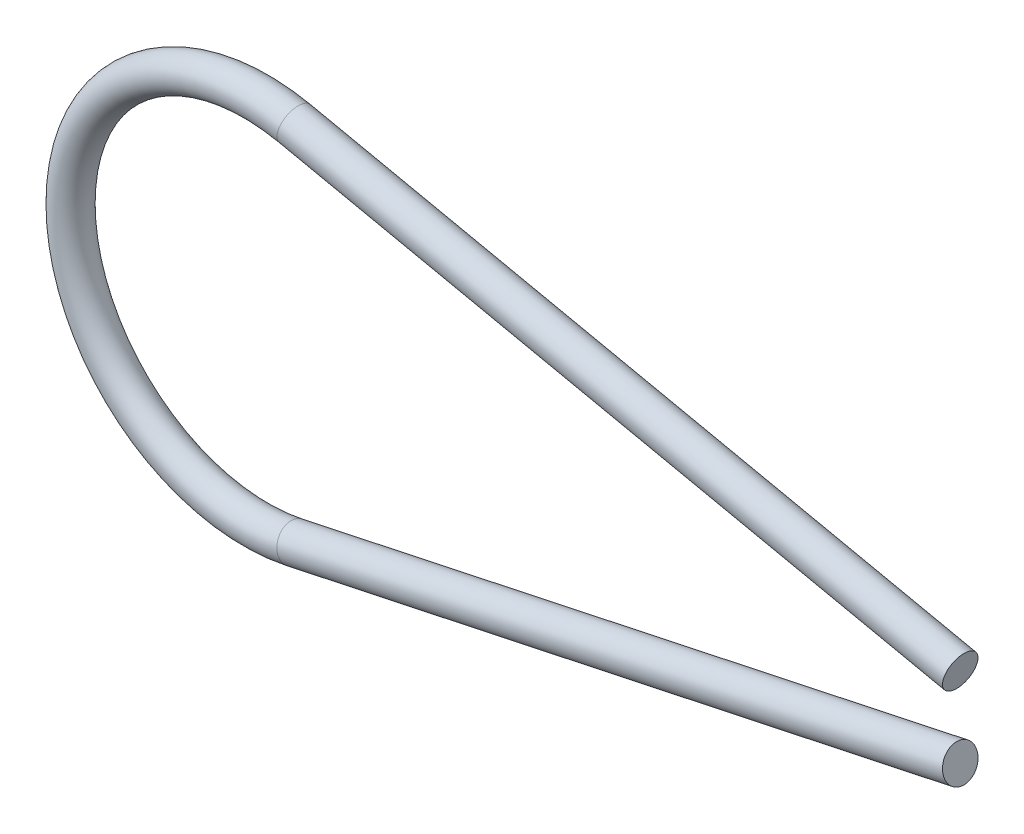
ISO-10303-21;
HEADER;
FILE_DESCRIPTION(('STEP AP214'),'2;1');
FILE_NAME('part.step','',(''),(''),'','','');
FILE_SCHEMA(('AUTOMOTIVE_DESIGN { 1 0 10303 214 1 1 1 1 }'));
ENDSEC;
DATA;
#1=APPLICATION_CONTEXT('core data for automotive mechanical design processes');
#2=APPLICATION_PROTOCOL_DEFINITION('international standard','automotive_design',2000,#1);
#3=PRODUCT_CONTEXT('',#1,'mechanical');
#4=PRODUCT('Part','Part','',(#3));
#5=PRODUCT_RELATED_PRODUCT_CATEGORY('part','',(#4));
#6=PRODUCT_DEFINITION_FORMATION('','',#4);
#7=PRODUCT_DEFINITION_CONTEXT('part definition',#1,'design');
#8=PRODUCT_DEFINITION('design','',#6,#7);
#9=PRODUCT_DEFINITION_SHAPE('','',#8);
#10=(LENGTH_UNIT() NAMED_UNIT(*) SI_UNIT(.MILLI.,.METRE.));
#11=(NAMED_UNIT(*) PLANE_ANGLE_UNIT() SI_UNIT($,.RADIAN.));
#12=(NAMED_UNIT(*) SI_UNIT($,.STERADIAN.) SOLID_ANGLE_UNIT());
#13=UNCERTAINTY_MEASURE_WITH_UNIT(LENGTH_MEASURE(1.E-05),#10,'distance_accuracy_value','');
#14=(GEOMETRIC_REPRESENTATION_CONTEXT(3) GLOBAL_UNCERTAINTY_ASSIGNED_CONTEXT((#13)) GLOBAL_UNIT_ASSIGNED_CONTEXT((#10,
#11,#12)) REPRESENTATION_CONTEXT('',''));
#15=CARTESIAN_POINT('',(0.,0.,0.));
#16=DIRECTION('',(0.,0.,1.));
#17=DIRECTION('',(1.,0.,0.));
#18=AXIS2_PLACEMENT_3D('',#15,#16,#17);
#19=CARTESIAN_POINT('',(0.332658705310615,-1.56503616118434,0.));
#20=DIRECTION('',(0.978147600733428,0.207911690819536,0.));
#21=DIRECTION('',(-0.207911690819536,0.978147600733428,0.));
#22=AXIS2_PLACEMENT_3D('',#19,#20,#21);
#23=CYLINDRICAL_SURFACE('',#22,0.15);
#24=CARTESIAN_POINT('',(0.332658705310615,-1.56503616118434,0.));
#25=DIRECTION('',(0.978147600734558,0.207911690814221,0.));
#26=DIRECTION('',(-0.207911690814221,0.978147600734558,0.));
#27=AXIS2_PLACEMENT_3D('',#24,#25,#26);
#28=CIRCLE('',#27,0.15);
#29=CARTESIAN_POINT('',(0.363845458933281,-1.71175830129441,0.));
#30=VERTEX_POINT('',#29);
#31=EDGE_CURVE('E39',#30,#30,#28,.T.);
#32=ORIENTED_EDGE('',*,*,#31,.T.);
#33=EDGE_LOOP('',(#32));
#34=FACE_BOUND('',#33,.T.);
#35=CARTESIAN_POINT('',(6.07438512161584,-0.344594536073662,0.));
#36=DIRECTION('',(0.978147600734558,0.207911690814221,0.));
#37=DIRECTION('',(-0.207911690814221,0.978147600734558,0.));
#38=AXIS2_PLACEMENT_3D('',#35,#36,#37);
#39=CIRCLE('',#38,0.15);
#40=CARTESIAN_POINT('',(6.04319836799371,-0.197872395963478,0.));
#41=VERTEX_POINT('',#40);
#42=EDGE_CURVE('E10',#41,#41,#39,.T.);
#43=ORIENTED_EDGE('',*,*,#42,.F.);
#44=EDGE_LOOP('',(#43));
#45=FACE_BOUND('',#44,.T.);
#46=ADVANCED_FACE('F33',(#34,#45),#23,.T.);
#47=CARTESIAN_POINT('',(0.,0.,0.));
#48=DIRECTION('',(0.,0.,1.));
#49=DIRECTION('',(1.,0.,0.));
#50=AXIS2_PLACEMENT_3D('',#47,#48,#49);
#51=TOROIDAL_SURFACE('',#50,1.60000000001048,0.15);
#52=CARTESIAN_POINT('',(0.332658705310596,1.56503616118434,0.));
#53=DIRECTION('',(-0.978147600733051,0.207911690821312,0.));
#54=DIRECTION('',(-0.207911690821312,-0.978147600733051,0.));
#55=AXIS2_PLACEMENT_3D('',#52,#53,#54);
#56=CIRCLE('',#55,0.15);
#57=CARTESIAN_POINT('',(0.36384545893326,1.71175830129441,0.));
#58=VERTEX_POINT('',#57);
#59=EDGE_CURVE('E43',#58,#58,#56,.T.);
#60=CARTESIAN_POINT('',(0.,0.,0.));
#61=DIRECTION('',(0.,0.,1.));
#62=DIRECTION('',(1.,0.,0.));
#63=AXIS2_PLACEMENT_3D('',#60,#61,#62);
#64=CIRCLE('',#63,1.75000000001048);
#65=EDGE_CURVE('',#58,#30,#64,.T.);
#66=ORIENTED_EDGE('',*,*,#59,.T.);
#67=ORIENTED_EDGE('',*,*,#31,.F.);
#68=ORIENTED_EDGE('',*,*,#65,.T.);
#69=ORIENTED_EDGE('',*,*,#65,.F.);
#70=EDGE_LOOP('',(#66,#68,#67,#69));
#71=FACE_BOUND('',#70,.T.);
#72=ADVANCED_FACE('F65',(#71),#51,.T.);
#73=CARTESIAN_POINT('',(0.332658705310596,1.56503616118434,0.));
#74=DIRECTION('',(0.978147600733051,-0.207911690821312,0.));
#75=DIRECTION('',(0.207911690821312,0.978147600733051,0.));
#76=AXIS2_PLACEMENT_3D('',#73,#74,#75);
#77=CYLINDRICAL_SURFACE('',#76,0.15);
#78=ORIENTED_EDGE('',*,*,#59,.F.);
#79=EDGE_LOOP('',(#78));
#80=FACE_BOUND('',#79,.T.);
#81=CARTESIAN_POINT('',(6.0743851216136,0.344594536063241,0.));
#82=DIRECTION('',(-0.978147600733051,0.207911690821312,0.));
#83=DIRECTION('',(-0.207911690821312,-0.978147600733051,0.));
#84=AXIS2_PLACEMENT_3D('',#81,#82,#83);
#85=CIRCLE('',#84,0.15);
#86=CARTESIAN_POINT('',(6.04319836799041,0.197872395953283,0.));
#87=VERTEX_POINT('',#86);
#88=EDGE_CURVE('E47',#87,#87,#85,.T.);
#89=ORIENTED_EDGE('',*,*,#88,.T.);
#90=EDGE_LOOP('',(#89));
#91=FACE_BOUND('',#90,.T.);
#92=ADVANCED_FACE('F53',(#80,#91),#77,.T.);
#93=CARTESIAN_POINT('',(6.07438512161584,-0.344594536073662,0.));
#94=DIRECTION('',(0.978147600734558,0.207911690814221,0.));
#95=DIRECTION('',(-0.207911690814221,0.978147600734558,0.));
#96=AXIS2_PLACEMENT_3D('',#93,#94,#95);
#97=PLANE('',#96);
#98=ORIENTED_EDGE('',*,*,#42,.T.);
#99=EDGE_LOOP('',(#98));
#100=FACE_BOUND('',#99,.T.);
#101=ADVANCED_FACE('F57',(#100),#97,.T.);
#102=CARTESIAN_POINT('',(6.0743851216136,0.344594536063241,0.));
#103=DIRECTION('',(-0.978147600733051,0.207911690821312,0.));
#104=DIRECTION('',(-0.207911690821312,-0.978147600733051,0.));
#105=AXIS2_PLACEMENT_3D('',#102,#103,#104);
#106=PLANE('',#105);
#107=ORIENTED_EDGE('',*,*,#88,.F.);
#108=EDGE_LOOP('',(#107));
#109=FACE_BOUND('',#108,.T.);
#110=ADVANCED_FACE('F55',(#109),#106,.F.);
#111=CLOSED_SHELL('',(#46,#72,#92,#101,#110));
#112=MANIFOLD_SOLID_BREP('B2',#111);
#113=ADVANCED_BREP_SHAPE_REPRESENTATION('',(#18,#112),#14);
#114=SHAPE_DEFINITION_REPRESENTATION(#9,#113);
ENDSEC;
END-ISO-10303-21;
